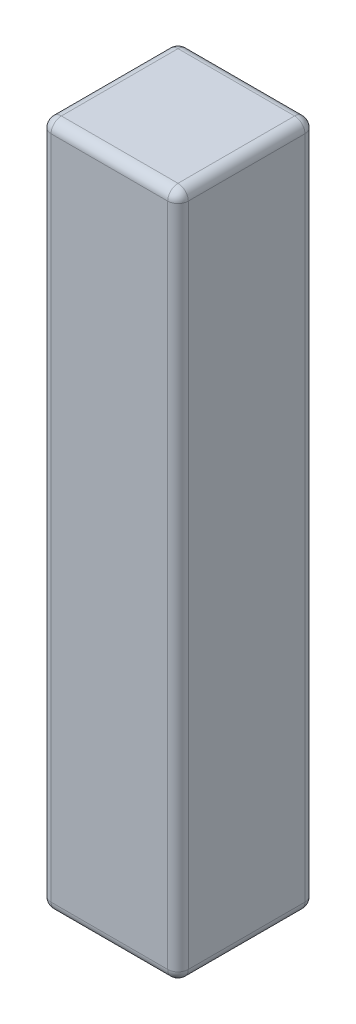
ISO-10303-21;
HEADER;
FILE_DESCRIPTION(('STEP AP214'),'2;1');
FILE_NAME('part.step','',(''),(''),'','','');
FILE_SCHEMA(('AUTOMOTIVE_DESIGN { 1 0 10303 214 1 1 1 1 }'));
ENDSEC;
DATA;
#1=APPLICATION_CONTEXT('core data for automotive mechanical design processes');
#2=APPLICATION_PROTOCOL_DEFINITION('international standard','automotive_design',2000,#1);
#3=PRODUCT_CONTEXT('',#1,'mechanical');
#4=PRODUCT('Part','Part','',(#3));
#5=PRODUCT_RELATED_PRODUCT_CATEGORY('part','',(#4));
#6=PRODUCT_DEFINITION_FORMATION('','',#4);
#7=PRODUCT_DEFINITION_CONTEXT('part definition',#1,'design');
#8=PRODUCT_DEFINITION('design','',#6,#7);
#9=PRODUCT_DEFINITION_SHAPE('','',#8);
#10=(LENGTH_UNIT() NAMED_UNIT(*) SI_UNIT(.MILLI.,.METRE.));
#11=(NAMED_UNIT(*) PLANE_ANGLE_UNIT() SI_UNIT($,.RADIAN.));
#12=(NAMED_UNIT(*) SI_UNIT($,.STERADIAN.) SOLID_ANGLE_UNIT());
#13=UNCERTAINTY_MEASURE_WITH_UNIT(LENGTH_MEASURE(1.E-05),#10,'distance_accuracy_value','');
#14=(GEOMETRIC_REPRESENTATION_CONTEXT(3) GLOBAL_UNCERTAINTY_ASSIGNED_CONTEXT((#13)) GLOBAL_UNIT_ASSIGNED_CONTEXT((#10,
#11,#12)) REPRESENTATION_CONTEXT('',''));
#15=CARTESIAN_POINT('',(0.,0.,0.));
#16=DIRECTION('',(0.,0.,1.));
#17=DIRECTION('',(1.,0.,0.));
#18=AXIS2_PLACEMENT_3D('',#15,#16,#17);
#19=CARTESIAN_POINT('',(-1.00000054,5.,-1.00000054));
#20=DIRECTION('',(1.,0.,0.));
#21=DIRECTION('',(0.,0.,-1.));
#22=AXIS2_PLACEMENT_3D('',#19,#20,#21);
#23=PLANE('',#22);
#24=DIRECTION('',(0.,-1.,0.));
#25=VECTOR('',#24,1.);
#26=CARTESIAN_POINT('',(-1.00000054,5.,0.85000054));
#27=LINE('',#26,#25);
#28=CARTESIAN_POINT('',(-1.00000054,-4.85,0.85000054));
#29=VERTEX_POINT('',#28);
#30=CARTESIAN_POINT('',(-1.00000054,4.85,0.85000054));
#31=VERTEX_POINT('',#30);
#32=EDGE_CURVE('E214',#29,#31,#27,.F.);
#33=ORIENTED_EDGE('',*,*,#32,.T.);
#34=DIRECTION('',(0.,0.,1.));
#35=VECTOR('',#34,1.);
#36=CARTESIAN_POINT('',(-1.00000054,4.85,-1.00000054));
#37=LINE('',#36,#35);
#38=CARTESIAN_POINT('',(-1.00000054,4.85,-0.85000054));
#39=VERTEX_POINT('',#38);
#40=EDGE_CURVE('E217',#31,#39,#37,.F.);
#41=ORIENTED_EDGE('',*,*,#40,.T.);
#42=DIRECTION('',(0.,-1.,0.));
#43=VECTOR('',#42,1.);
#44=CARTESIAN_POINT('',(-1.00000054,5.,-0.85000054));
#45=LINE('',#44,#43);
#46=CARTESIAN_POINT('',(-1.00000054,-4.85,-0.85000054));
#47=VERTEX_POINT('',#46);
#48=EDGE_CURVE('E215',#39,#47,#45,.T.);
#49=ORIENTED_EDGE('',*,*,#48,.T.);
#50=DIRECTION('',(0.,0.,1.));
#51=VECTOR('',#50,1.);
#52=CARTESIAN_POINT('',(-1.00000054,-4.85,-1.00000054));
#53=LINE('',#52,#51);
#54=EDGE_CURVE('E211',#47,#29,#53,.T.);
#55=ORIENTED_EDGE('',*,*,#54,.T.);
#56=EDGE_LOOP('',(#33,#41,#49,#55));
#57=FACE_BOUND('',#56,.T.);
#58=ADVANCED_FACE('F32',(#57),#23,.F.);
#59=CARTESIAN_POINT('',(-1.00000054,5.,1.00000054));
#60=DIRECTION('',(0.,0.,-1.));
#61=DIRECTION('',(-1.,0.,0.));
#62=AXIS2_PLACEMENT_3D('',#59,#60,#61);
#63=PLANE('',#62);
#64=DIRECTION('',(1.,0.,0.));
#65=VECTOR('',#64,1.);
#66=CARTESIAN_POINT('',(-1.00000054,-4.85,1.00000054));
#67=LINE('',#66,#65);
#68=CARTESIAN_POINT('',(-0.850000540000001,-4.85,1.00000054));
#69=VERTEX_POINT('',#68);
#70=CARTESIAN_POINT('',(0.85000054,-4.85,1.00000054));
#71=VERTEX_POINT('',#70);
#72=EDGE_CURVE('E255',#69,#71,#67,.T.);
#73=ORIENTED_EDGE('',*,*,#72,.T.);
#74=DIRECTION('',(0.,-1.,0.));
#75=VECTOR('',#74,1.);
#76=CARTESIAN_POINT('',(0.85000054,5.,1.00000054));
#77=LINE('',#76,#75);
#78=CARTESIAN_POINT('',(0.85000054,4.85,1.00000054));
#79=VERTEX_POINT('',#78);
#80=EDGE_CURVE('E261',#71,#79,#77,.F.);
#81=ORIENTED_EDGE('',*,*,#80,.T.);
#82=DIRECTION('',(1.,0.,0.));
#83=VECTOR('',#82,1.);
#84=CARTESIAN_POINT('',(-1.00000054,4.85,1.00000054));
#85=LINE('',#84,#83);
#86=CARTESIAN_POINT('',(-0.850000540000001,4.85,1.00000054));
#87=VERTEX_POINT('',#86);
#88=EDGE_CURVE('E258',#79,#87,#85,.F.);
#89=ORIENTED_EDGE('',*,*,#88,.T.);
#90=DIRECTION('',(0.,-1.,0.));
#91=VECTOR('',#90,1.);
#92=CARTESIAN_POINT('',(-0.850000540000001,5.,1.00000054));
#93=LINE('',#92,#91);
#94=EDGE_CURVE('E250',#87,#69,#93,.T.);
#95=ORIENTED_EDGE('',*,*,#94,.T.);
#96=EDGE_LOOP('',(#73,#81,#89,#95));
#97=FACE_BOUND('',#96,.T.);
#98=ADVANCED_FACE('F259',(#97),#63,.F.);
#99=CARTESIAN_POINT('',(1.00000054,5.,-1.00000054));
#100=DIRECTION('',(-1.,0.,0.));
#101=DIRECTION('',(0.,0.,1.));
#102=AXIS2_PLACEMENT_3D('',#99,#100,#101);
#103=PLANE('',#102);
#104=DIRECTION('',(0.,0.,-1.));
#105=VECTOR('',#104,1.);
#106=CARTESIAN_POINT('',(1.00000054,4.85,1.00000054));
#107=LINE('',#106,#105);
#108=CARTESIAN_POINT('',(1.00000054,4.85,-0.85000054));
#109=VERTEX_POINT('',#108);
#110=CARTESIAN_POINT('',(1.00000054,4.85,0.85000054));
#111=VERTEX_POINT('',#110);
#112=EDGE_CURVE('E151',#109,#111,#107,.F.);
#113=ORIENTED_EDGE('',*,*,#112,.T.);
#114=DIRECTION('',(0.,-1.,0.));
#115=VECTOR('',#114,1.);
#116=CARTESIAN_POINT('',(1.00000054,5.,0.85000054));
#117=LINE('',#116,#115);
#118=CARTESIAN_POINT('',(1.00000054,-4.85,0.85000054));
#119=VERTEX_POINT('',#118);
#120=EDGE_CURVE('E219',#111,#119,#117,.T.);
#121=ORIENTED_EDGE('',*,*,#120,.T.);
#122=DIRECTION('',(0.,0.,-1.));
#123=VECTOR('',#122,1.);
#124=CARTESIAN_POINT('',(1.00000054,-4.85,-1.00000054));
#125=LINE('',#124,#123);
#126=CARTESIAN_POINT('',(1.00000054,-4.85,-0.85000054));
#127=VERTEX_POINT('',#126);
#128=EDGE_CURVE('E278',#119,#127,#125,.T.);
#129=ORIENTED_EDGE('',*,*,#128,.T.);
#130=DIRECTION('',(0.,-1.,0.));
#131=VECTOR('',#130,1.);
#132=CARTESIAN_POINT('',(1.00000054,5.,-0.85000054));
#133=LINE('',#132,#131);
#134=EDGE_CURVE('E276',#127,#109,#133,.F.);
#135=ORIENTED_EDGE('',*,*,#134,.T.);
#136=EDGE_LOOP('',(#113,#121,#129,#135));
#137=FACE_BOUND('',#136,.T.);
#138=ADVANCED_FACE('F283',(#137),#103,.F.);
#139=CARTESIAN_POINT('',(-1.00000054,5.,-1.00000054));
#140=DIRECTION('',(0.,0.,1.));
#141=DIRECTION('',(1.,0.,0.));
#142=AXIS2_PLACEMENT_3D('',#139,#140,#141);
#143=PLANE('',#142);
#144=DIRECTION('',(-1.,0.,0.));
#145=VECTOR('',#144,1.);
#146=CARTESIAN_POINT('',(1.00000054,4.85,-1.00000054));
#147=LINE('',#146,#145);
#148=CARTESIAN_POINT('',(-0.85000054,4.85,-1.00000054));
#149=VERTEX_POINT('',#148);
#150=CARTESIAN_POINT('',(0.85000054,4.85,-1.00000054));
#151=VERTEX_POINT('',#150);
#152=EDGE_CURVE('E41',#149,#151,#147,.F.);
#153=ORIENTED_EDGE('',*,*,#152,.T.);
#154=DIRECTION('',(0.,-1.,0.));
#155=VECTOR('',#154,1.);
#156=CARTESIAN_POINT('',(0.85000054,5.,-1.00000054));
#157=LINE('',#156,#155);
#158=CARTESIAN_POINT('',(0.85000054,-4.85,-1.00000054));
#159=VERTEX_POINT('',#158);
#160=EDGE_CURVE('E11',#151,#159,#157,.T.);
#161=ORIENTED_EDGE('',*,*,#160,.T.);
#162=DIRECTION('',(-1.,0.,0.));
#163=VECTOR('',#162,1.);
#164=CARTESIAN_POINT('',(-1.00000054,-4.85,-1.00000054));
#165=LINE('',#164,#163);
#166=CARTESIAN_POINT('',(-0.85000054,-4.85,-1.00000054));
#167=VERTEX_POINT('',#166);
#168=EDGE_CURVE('E225',#159,#167,#165,.T.);
#169=ORIENTED_EDGE('',*,*,#168,.T.);
#170=DIRECTION('',(0.,-1.,0.));
#171=VECTOR('',#170,1.);
#172=CARTESIAN_POINT('',(-0.85000054,5.,-1.00000054));
#173=LINE('',#172,#171);
#174=EDGE_CURVE('E52',#167,#149,#173,.F.);
#175=ORIENTED_EDGE('',*,*,#174,.T.);
#176=EDGE_LOOP('',(#153,#161,#169,#175));
#177=FACE_BOUND('',#176,.T.);
#178=ADVANCED_FACE('F354',(#177),#143,.F.);
#179=CARTESIAN_POINT('',(-1.00000054,5.,1.00000054));
#180=DIRECTION('',(0.,1.,0.));
#181=DIRECTION('',(0.,0.,1.));
#182=AXIS2_PLACEMENT_3D('',#179,#180,#181);
#183=PLANE('',#182);
#184=DIRECTION('',(0.,0.,1.));
#185=VECTOR('',#184,1.);
#186=CARTESIAN_POINT('',(-0.850000540000001,5.,1.00000054));
#187=LINE('',#186,#185);
#188=CARTESIAN_POINT('',(-0.85000054,5.,-0.85000054));
#189=VERTEX_POINT('',#188);
#190=CARTESIAN_POINT('',(-0.850000540000001,5.,0.85000054));
#191=VERTEX_POINT('',#190);
#192=EDGE_CURVE('E130',#189,#191,#187,.T.);
#193=ORIENTED_EDGE('',*,*,#192,.T.);
#194=DIRECTION('',(1.,0.,0.));
#195=VECTOR('',#194,1.);
#196=CARTESIAN_POINT('',(1.00000054,5.,0.85000054));
#197=LINE('',#196,#195);
#198=CARTESIAN_POINT('',(0.85000054,5.,0.85000054));
#199=VERTEX_POINT('',#198);
#200=EDGE_CURVE('E126',#191,#199,#197,.T.);
#201=ORIENTED_EDGE('',*,*,#200,.T.);
#202=DIRECTION('',(0.,0.,-1.));
#203=VECTOR('',#202,1.);
#204=CARTESIAN_POINT('',(0.85000054,5.,-1.00000054));
#205=LINE('',#204,#203);
#206=CARTESIAN_POINT('',(0.85000054,5.,-0.85000054));
#207=VERTEX_POINT('',#206);
#208=EDGE_CURVE('E120',#199,#207,#205,.T.);
#209=ORIENTED_EDGE('',*,*,#208,.T.);
#210=DIRECTION('',(-1.,0.,0.));
#211=VECTOR('',#210,1.);
#212=CARTESIAN_POINT('',(-1.00000054,5.,-0.85000054));
#213=LINE('',#212,#211);
#214=EDGE_CURVE('E123',#207,#189,#213,.T.);
#215=ORIENTED_EDGE('',*,*,#214,.T.);
#216=EDGE_LOOP('',(#193,#201,#209,#215));
#217=FACE_BOUND('',#216,.T.);
#218=ADVANCED_FACE('F122',(#217),#183,.T.);
#219=CARTESIAN_POINT('',(-1.00000054,-5.,1.00000054));
#220=DIRECTION('',(0.,1.,0.));
#221=DIRECTION('',(0.,0.,1.));
#222=AXIS2_PLACEMENT_3D('',#219,#220,#221);
#223=PLANE('',#222);
#224=DIRECTION('',(0.,0.,-1.));
#225=VECTOR('',#224,1.);
#226=CARTESIAN_POINT('',(0.85000054,-5.,1.00000054));
#227=LINE('',#226,#225);
#228=CARTESIAN_POINT('',(0.85000054,-5.,-0.85000054));
#229=VERTEX_POINT('',#228);
#230=CARTESIAN_POINT('',(0.85000054,-5.,0.85000054));
#231=VERTEX_POINT('',#230);
#232=EDGE_CURVE('E272',#229,#231,#227,.F.);
#233=ORIENTED_EDGE('',*,*,#232,.T.);
#234=DIRECTION('',(1.,0.,0.));
#235=VECTOR('',#234,1.);
#236=CARTESIAN_POINT('',(-1.00000054,-5.,0.85000054));
#237=LINE('',#236,#235);
#238=CARTESIAN_POINT('',(-0.85000054,-5.,0.85000054));
#239=VERTEX_POINT('',#238);
#240=EDGE_CURVE('E274',#231,#239,#237,.F.);
#241=ORIENTED_EDGE('',*,*,#240,.T.);
#242=DIRECTION('',(0.,0.,1.));
#243=VECTOR('',#242,1.);
#244=CARTESIAN_POINT('',(-0.850000540000001,-5.,1.00000054));
#245=LINE('',#244,#243);
#246=CARTESIAN_POINT('',(-0.85000054,-5.,-0.85000054));
#247=VERTEX_POINT('',#246);
#248=EDGE_CURVE('E209',#239,#247,#245,.F.);
#249=ORIENTED_EDGE('',*,*,#248,.T.);
#250=DIRECTION('',(-1.,0.,0.));
#251=VECTOR('',#250,1.);
#252=CARTESIAN_POINT('',(-1.00000054,-5.,-0.85000054));
#253=LINE('',#252,#251);
#254=EDGE_CURVE('E266',#247,#229,#253,.F.);
#255=ORIENTED_EDGE('',*,*,#254,.T.);
#256=EDGE_LOOP('',(#233,#241,#249,#255));
#257=FACE_BOUND('',#256,.T.);
#258=ADVANCED_FACE('F355',(#257),#223,.F.);
#259=CARTESIAN_POINT('',(-1.00000054,-4.85,-0.85000054));
#260=DIRECTION('',(-1.,0.,0.));
#261=DIRECTION('',(0.,0.,1.));
#262=AXIS2_PLACEMENT_3D('',#259,#260,#261);
#263=CYLINDRICAL_SURFACE('',#262,0.15);
#264=CARTESIAN_POINT('',(-0.85000054,-4.85,-0.85000054));
#265=DIRECTION('',(-1.,0.,0.));
#266=DIRECTION('',(0.,0.,1.));
#267=AXIS2_PLACEMENT_3D('',#264,#265,#266);
#268=CIRCLE('',#267,0.15);
#269=EDGE_CURVE('E36',#167,#247,#268,.T.);
#270=ORIENTED_EDGE('',*,*,#269,.F.);
#271=ORIENTED_EDGE('',*,*,#168,.F.);
#272=CARTESIAN_POINT('',(0.85000054,-4.85,-0.85000054));
#273=DIRECTION('',(1.,0.,0.));
#274=DIRECTION('',(0.,0.,-1.));
#275=AXIS2_PLACEMENT_3D('',#272,#273,#274);
#276=CIRCLE('',#275,0.15);
#277=EDGE_CURVE('E189',#229,#159,#276,.T.);
#278=ORIENTED_EDGE('',*,*,#277,.F.);
#279=ORIENTED_EDGE('',*,*,#254,.F.);
#280=EDGE_LOOP('',(#270,#271,#278,#279));
#281=FACE_BOUND('',#280,.T.);
#282=ADVANCED_FACE('F34',(#281),#263,.T.);
#283=CARTESIAN_POINT('',(-0.85000054,-4.85,-0.85000054));
#284=DIRECTION('',(0.,0.,1.));
#285=DIRECTION('',(1.,0.,0.));
#286=AXIS2_PLACEMENT_3D('',#283,#284,#285);
#287=SPHERICAL_SURFACE('',#286,0.15);
#288=CARTESIAN_POINT('',(-0.85000054,-4.85,-0.85000054));
#289=DIRECTION('',(0.,-1.,0.));
#290=DIRECTION('',(0.,0.,-1.));
#291=AXIS2_PLACEMENT_3D('',#288,#289,#290);
#292=CIRCLE('',#291,0.15);
#293=EDGE_CURVE('E184',#167,#47,#292,.F.);
#294=ORIENTED_EDGE('',*,*,#293,.F.);
#295=ORIENTED_EDGE('',*,*,#269,.T.);
#296=CARTESIAN_POINT('',(-0.85000054,-4.85,-0.85000054));
#297=DIRECTION('',(0.,0.,-1.));
#298=DIRECTION('',(-1.,0.,0.));
#299=AXIS2_PLACEMENT_3D('',#296,#297,#298);
#300=CIRCLE('',#299,0.15);
#301=EDGE_CURVE('E187',#47,#247,#300,.F.);
#302=ORIENTED_EDGE('',*,*,#301,.F.);
#303=EDGE_LOOP('',(#294,#295,#302));
#304=FACE_BOUND('',#303,.T.);
#305=ADVANCED_FACE('F201',(#304),#287,.T.);
#306=CARTESIAN_POINT('',(0.85000054,-4.85,-0.85000054));
#307=DIRECTION('',(0.,0.,1.));
#308=DIRECTION('',(1.,0.,0.));
#309=AXIS2_PLACEMENT_3D('',#306,#307,#308);
#310=SPHERICAL_SURFACE('',#309,0.15);
#311=CARTESIAN_POINT('',(0.85000054,-4.85,-0.85000054));
#312=DIRECTION('',(0.,0.,-1.));
#313=DIRECTION('',(-1.,0.,0.));
#314=AXIS2_PLACEMENT_3D('',#311,#312,#313);
#315=CIRCLE('',#314,0.15);
#316=EDGE_CURVE('E179',#229,#127,#315,.F.);
#317=ORIENTED_EDGE('',*,*,#316,.F.);
#318=ORIENTED_EDGE('',*,*,#277,.T.);
#319=CARTESIAN_POINT('',(0.85000054,-4.85,-0.85000054));
#320=DIRECTION('',(0.,-1.,0.));
#321=DIRECTION('',(0.,0.,-1.));
#322=AXIS2_PLACEMENT_3D('',#319,#320,#321);
#323=CIRCLE('',#322,0.15);
#324=EDGE_CURVE('E182',#127,#159,#323,.F.);
#325=ORIENTED_EDGE('',*,*,#324,.F.);
#326=EDGE_LOOP('',(#317,#318,#325));
#327=FACE_BOUND('',#326,.T.);
#328=ADVANCED_FACE('F351',(#327),#310,.T.);
#329=CARTESIAN_POINT('',(-0.85000054,-4.85,-1.00000054));
#330=DIRECTION('',(0.,0.,1.));
#331=DIRECTION('',(1.,0.,0.));
#332=AXIS2_PLACEMENT_3D('',#329,#330,#331);
#333=CYLINDRICAL_SURFACE('',#332,0.15);
#334=ORIENTED_EDGE('',*,*,#301,.T.);
#335=ORIENTED_EDGE('',*,*,#248,.F.);
#336=CARTESIAN_POINT('',(-0.85000054,-4.85,0.85000054));
#337=DIRECTION('',(0.,0.,1.));
#338=DIRECTION('',(1.,0.,0.));
#339=AXIS2_PLACEMENT_3D('',#336,#337,#338);
#340=CIRCLE('',#339,0.15);
#341=EDGE_CURVE('E174',#29,#239,#340,.T.);
#342=ORIENTED_EDGE('',*,*,#341,.F.);
#343=ORIENTED_EDGE('',*,*,#54,.F.);
#344=EDGE_LOOP('',(#334,#335,#342,#343));
#345=FACE_BOUND('',#344,.T.);
#346=ADVANCED_FACE('F207',(#345),#333,.T.);
#347=CARTESIAN_POINT('',(-0.85000054,5.,-0.85000054));
#348=DIRECTION('',(0.,-1.,0.));
#349=DIRECTION('',(0.,0.,-1.));
#350=AXIS2_PLACEMENT_3D('',#347,#348,#349);
#351=CYLINDRICAL_SURFACE('',#350,0.15);
#352=ORIENTED_EDGE('',*,*,#293,.T.);
#353=ORIENTED_EDGE('',*,*,#48,.F.);
#354=CARTESIAN_POINT('',(-0.85000054,4.85,-0.85000054));
#355=DIRECTION('',(0.,1.,0.));
#356=DIRECTION('',(0.,0.,1.));
#357=AXIS2_PLACEMENT_3D('',#354,#355,#356);
#358=CIRCLE('',#357,0.15);
#359=EDGE_CURVE('E171',#149,#39,#358,.T.);
#360=ORIENTED_EDGE('',*,*,#359,.F.);
#361=ORIENTED_EDGE('',*,*,#174,.F.);
#362=EDGE_LOOP('',(#352,#353,#360,#361));
#363=FACE_BOUND('',#362,.T.);
#364=ADVANCED_FACE('F300',(#363),#351,.T.);
#365=CARTESIAN_POINT('',(-1.00000054,4.85,-0.85000054));
#366=DIRECTION('',(1.,0.,0.));
#367=DIRECTION('',(0.,0.,-1.));
#368=AXIS2_PLACEMENT_3D('',#365,#366,#367);
#369=CYLINDRICAL_SURFACE('',#368,0.15);
#370=CARTESIAN_POINT('',(0.85000054,4.85,-0.85000054));
#371=DIRECTION('',(1.,0.,0.));
#372=DIRECTION('',(0.,0.,-1.));
#373=AXIS2_PLACEMENT_3D('',#370,#371,#372);
#374=CIRCLE('',#373,0.15);
#375=EDGE_CURVE('E136',#151,#207,#374,.T.);
#376=ORIENTED_EDGE('',*,*,#375,.F.);
#377=ORIENTED_EDGE('',*,*,#152,.F.);
#378=CARTESIAN_POINT('',(-0.85000054,4.85,-0.85000054));
#379=DIRECTION('',(-1.,0.,0.));
#380=DIRECTION('',(0.,0.,1.));
#381=AXIS2_PLACEMENT_3D('',#378,#379,#380);
#382=CIRCLE('',#381,0.15);
#383=EDGE_CURVE('E139',#189,#149,#382,.T.);
#384=ORIENTED_EDGE('',*,*,#383,.F.);
#385=ORIENTED_EDGE('',*,*,#214,.F.);
#386=EDGE_LOOP('',(#376,#377,#384,#385));
#387=FACE_BOUND('',#386,.T.);
#388=ADVANCED_FACE('F135',(#387),#369,.T.);
#389=CARTESIAN_POINT('',(0.85000054,5.,-0.85000054));
#390=DIRECTION('',(0.,-1.,0.));
#391=DIRECTION('',(0.,0.,-1.));
#392=AXIS2_PLACEMENT_3D('',#389,#390,#391);
#393=CYLINDRICAL_SURFACE('',#392,0.15);
#394=ORIENTED_EDGE('',*,*,#324,.T.);
#395=ORIENTED_EDGE('',*,*,#160,.F.);
#396=CARTESIAN_POINT('',(0.85000054,4.85,-0.85000054));
#397=DIRECTION('',(0.,1.,0.));
#398=DIRECTION('',(0.,0.,1.));
#399=AXIS2_PLACEMENT_3D('',#396,#397,#398);
#400=CIRCLE('',#399,0.15);
#401=EDGE_CURVE('E148',#109,#151,#400,.T.);
#402=ORIENTED_EDGE('',*,*,#401,.F.);
#403=ORIENTED_EDGE('',*,*,#134,.F.);
#404=EDGE_LOOP('',(#394,#395,#402,#403));
#405=FACE_BOUND('',#404,.T.);
#406=ADVANCED_FACE('F353',(#405),#393,.T.);
#407=CARTESIAN_POINT('',(0.85000054,-4.85,-1.00000054));
#408=DIRECTION('',(0.,0.,-1.));
#409=DIRECTION('',(-1.,0.,0.));
#410=AXIS2_PLACEMENT_3D('',#407,#408,#409);
#411=CYLINDRICAL_SURFACE('',#410,0.15);
#412=ORIENTED_EDGE('',*,*,#316,.T.);
#413=ORIENTED_EDGE('',*,*,#128,.F.);
#414=CARTESIAN_POINT('',(0.85000054,-4.85,0.85000054));
#415=DIRECTION('',(0.,0.,1.));
#416=DIRECTION('',(1.,0.,0.));
#417=AXIS2_PLACEMENT_3D('',#414,#415,#416);
#418=CIRCLE('',#417,0.15);
#419=EDGE_CURVE('E166',#231,#119,#418,.T.);
#420=ORIENTED_EDGE('',*,*,#419,.F.);
#421=ORIENTED_EDGE('',*,*,#232,.F.);
#422=EDGE_LOOP('',(#412,#413,#420,#421));
#423=FACE_BOUND('',#422,.T.);
#424=ADVANCED_FACE('F349',(#423),#411,.T.);
#425=CARTESIAN_POINT('',(-1.00000054,-4.85,0.85000054));
#426=DIRECTION('',(1.,0.,0.));
#427=DIRECTION('',(0.,0.,-1.));
#428=AXIS2_PLACEMENT_3D('',#425,#426,#427);
#429=CYLINDRICAL_SURFACE('',#428,0.15);
#430=CARTESIAN_POINT('',(-0.85000054,-4.85,0.85000054));
#431=DIRECTION('',(-1.,0.,0.));
#432=DIRECTION('',(0.,0.,1.));
#433=AXIS2_PLACEMENT_3D('',#430,#431,#432);
#434=CIRCLE('',#433,0.15);
#435=EDGE_CURVE('E176',#239,#69,#434,.T.);
#436=ORIENTED_EDGE('',*,*,#435,.F.);
#437=ORIENTED_EDGE('',*,*,#240,.F.);
#438=CARTESIAN_POINT('',(0.85000054,-4.85,0.85000054));
#439=DIRECTION('',(1.,0.,0.));
#440=DIRECTION('',(0.,0.,-1.));
#441=AXIS2_PLACEMENT_3D('',#438,#439,#440);
#442=CIRCLE('',#441,0.15);
#443=EDGE_CURVE('E163',#71,#231,#442,.T.);
#444=ORIENTED_EDGE('',*,*,#443,.F.);
#445=ORIENTED_EDGE('',*,*,#72,.F.);
#446=EDGE_LOOP('',(#436,#437,#444,#445));
#447=FACE_BOUND('',#446,.T.);
#448=ADVANCED_FACE('F312',(#447),#429,.T.);
#449=CARTESIAN_POINT('',(-0.85000054,-4.85,0.85000054));
#450=DIRECTION('',(0.,0.,1.));
#451=DIRECTION('',(1.,0.,0.));
#452=AXIS2_PLACEMENT_3D('',#449,#450,#451);
#453=SPHERICAL_SURFACE('',#452,0.15);
#454=ORIENTED_EDGE('',*,*,#341,.T.);
#455=ORIENTED_EDGE('',*,*,#435,.T.);
#456=CARTESIAN_POINT('',(-0.85000054,-4.85,0.85000054));
#457=DIRECTION('',(0.,-1.,0.));
#458=DIRECTION('',(0.,0.,-1.));
#459=AXIS2_PLACEMENT_3D('',#456,#457,#458);
#460=CIRCLE('',#459,0.15);
#461=EDGE_CURVE('E155',#29,#69,#460,.F.);
#462=ORIENTED_EDGE('',*,*,#461,.F.);
#463=EDGE_LOOP('',(#454,#455,#462));
#464=FACE_BOUND('',#463,.T.);
#465=ADVANCED_FACE('F304',(#464),#453,.T.);
#466=CARTESIAN_POINT('',(-0.85000054,4.85,-0.85000054));
#467=DIRECTION('',(0.,0.,1.));
#468=DIRECTION('',(1.,0.,0.));
#469=AXIS2_PLACEMENT_3D('',#466,#467,#468);
#470=SPHERICAL_SURFACE('',#469,0.15);
#471=ORIENTED_EDGE('',*,*,#383,.T.);
#472=ORIENTED_EDGE('',*,*,#359,.T.);
#473=CARTESIAN_POINT('',(-0.85000054,4.85,-0.85000054));
#474=DIRECTION('',(0.,0.,-1.));
#475=DIRECTION('',(-1.,0.,0.));
#476=AXIS2_PLACEMENT_3D('',#473,#474,#475);
#477=CIRCLE('',#476,0.15);
#478=EDGE_CURVE('E152',#189,#39,#477,.F.);
#479=ORIENTED_EDGE('',*,*,#478,.F.);
#480=EDGE_LOOP('',(#471,#472,#479));
#481=FACE_BOUND('',#480,.T.);
#482=ADVANCED_FACE('F302',(#481),#470,.T.);
#483=CARTESIAN_POINT('',(0.85000054,4.85,-0.85000054));
#484=DIRECTION('',(0.,0.,1.));
#485=DIRECTION('',(1.,0.,0.));
#486=AXIS2_PLACEMENT_3D('',#483,#484,#485);
#487=SPHERICAL_SURFACE('',#486,0.15);
#488=ORIENTED_EDGE('',*,*,#401,.T.);
#489=ORIENTED_EDGE('',*,*,#375,.T.);
#490=CARTESIAN_POINT('',(0.85000054,4.85,-0.85000054));
#491=DIRECTION('',(0.,0.,-1.));
#492=DIRECTION('',(-1.,0.,0.));
#493=AXIS2_PLACEMENT_3D('',#490,#491,#492);
#494=CIRCLE('',#493,0.15);
#495=EDGE_CURVE('E145',#109,#207,#494,.F.);
#496=ORIENTED_EDGE('',*,*,#495,.F.);
#497=EDGE_LOOP('',(#488,#489,#496));
#498=FACE_BOUND('',#497,.T.);
#499=ADVANCED_FACE('F144',(#498),#487,.T.);
#500=CARTESIAN_POINT('',(0.85000054,-4.85,0.85000054));
#501=DIRECTION('',(0.,0.,1.));
#502=DIRECTION('',(1.,0.,0.));
#503=AXIS2_PLACEMENT_3D('',#500,#501,#502);
#504=SPHERICAL_SURFACE('',#503,0.15);
#505=ORIENTED_EDGE('',*,*,#443,.T.);
#506=ORIENTED_EDGE('',*,*,#419,.T.);
#507=CARTESIAN_POINT('',(0.85000054,-4.85,0.85000054));
#508=DIRECTION('',(0.,-1.,0.));
#509=DIRECTION('',(0.,0.,-1.));
#510=AXIS2_PLACEMENT_3D('',#507,#508,#509);
#511=CIRCLE('',#510,0.15);
#512=EDGE_CURVE('E153',#71,#119,#511,.F.);
#513=ORIENTED_EDGE('',*,*,#512,.F.);
#514=EDGE_LOOP('',(#505,#506,#513));
#515=FACE_BOUND('',#514,.T.);
#516=ADVANCED_FACE('F310',(#515),#504,.T.);
#517=CARTESIAN_POINT('',(-0.850000540000001,5.,0.85000054));
#518=DIRECTION('',(0.,-1.,0.));
#519=DIRECTION('',(0.,0.,-1.));
#520=AXIS2_PLACEMENT_3D('',#517,#518,#519);
#521=CYLINDRICAL_SURFACE('',#520,0.15);
#522=ORIENTED_EDGE('',*,*,#461,.T.);
#523=ORIENTED_EDGE('',*,*,#94,.F.);
#524=CARTESIAN_POINT('',(-0.850000540000001,4.85,0.85000054));
#525=DIRECTION('',(0.,1.,0.));
#526=DIRECTION('',(0.,0.,1.));
#527=AXIS2_PLACEMENT_3D('',#524,#525,#526);
#528=CIRCLE('',#527,0.15);
#529=EDGE_CURVE('E157',#31,#87,#528,.T.);
#530=ORIENTED_EDGE('',*,*,#529,.F.);
#531=ORIENTED_EDGE('',*,*,#32,.F.);
#532=EDGE_LOOP('',(#522,#523,#530,#531));
#533=FACE_BOUND('',#532,.T.);
#534=ADVANCED_FACE('F252',(#533),#521,.T.);
#535=CARTESIAN_POINT('',(-0.850000540000001,4.85,1.00000054));
#536=DIRECTION('',(0.,0.,-1.));
#537=DIRECTION('',(-1.,0.,0.));
#538=AXIS2_PLACEMENT_3D('',#535,#536,#537);
#539=CYLINDRICAL_SURFACE('',#538,0.15);
#540=ORIENTED_EDGE('',*,*,#478,.T.);
#541=ORIENTED_EDGE('',*,*,#40,.F.);
#542=CARTESIAN_POINT('',(-0.850000540000001,4.85,0.85000054));
#543=DIRECTION('',(0.,0.,1.));
#544=DIRECTION('',(1.,0.,0.));
#545=AXIS2_PLACEMENT_3D('',#542,#543,#544);
#546=CIRCLE('',#545,0.15);
#547=EDGE_CURVE('E239',#191,#31,#546,.T.);
#548=ORIENTED_EDGE('',*,*,#547,.F.);
#549=ORIENTED_EDGE('',*,*,#192,.F.);
#550=EDGE_LOOP('',(#540,#541,#548,#549));
#551=FACE_BOUND('',#550,.T.);
#552=ADVANCED_FACE('F296',(#551),#539,.T.);
#553=CARTESIAN_POINT('',(0.85000054,4.85,1.00000054));
#554=DIRECTION('',(0.,0.,1.));
#555=DIRECTION('',(1.,0.,0.));
#556=AXIS2_PLACEMENT_3D('',#553,#554,#555);
#557=CYLINDRICAL_SURFACE('',#556,0.15);
#558=ORIENTED_EDGE('',*,*,#495,.T.);
#559=ORIENTED_EDGE('',*,*,#208,.F.);
#560=CARTESIAN_POINT('',(0.85000054,4.85,0.85000054));
#561=DIRECTION('',(0.,0.,1.));
#562=DIRECTION('',(1.,0.,0.));
#563=AXIS2_PLACEMENT_3D('',#560,#561,#562);
#564=CIRCLE('',#563,0.15);
#565=EDGE_CURVE('E236',#111,#199,#564,.T.);
#566=ORIENTED_EDGE('',*,*,#565,.F.);
#567=ORIENTED_EDGE('',*,*,#112,.F.);
#568=EDGE_LOOP('',(#558,#559,#566,#567));
#569=FACE_BOUND('',#568,.T.);
#570=ADVANCED_FACE('F150',(#569),#557,.T.);
#571=CARTESIAN_POINT('',(0.85000054,5.,0.85000054));
#572=DIRECTION('',(0.,-1.,0.));
#573=DIRECTION('',(0.,0.,-1.));
#574=AXIS2_PLACEMENT_3D('',#571,#572,#573);
#575=CYLINDRICAL_SURFACE('',#574,0.15);
#576=ORIENTED_EDGE('',*,*,#512,.T.);
#577=ORIENTED_EDGE('',*,*,#120,.F.);
#578=CARTESIAN_POINT('',(0.85000054,4.85,0.85000054));
#579=DIRECTION('',(0.,1.,0.));
#580=DIRECTION('',(0.,0.,1.));
#581=AXIS2_PLACEMENT_3D('',#578,#579,#580);
#582=CIRCLE('',#581,0.15);
#583=EDGE_CURVE('E233',#79,#111,#582,.T.);
#584=ORIENTED_EDGE('',*,*,#583,.F.);
#585=ORIENTED_EDGE('',*,*,#80,.F.);
#586=EDGE_LOOP('',(#576,#577,#584,#585));
#587=FACE_BOUND('',#586,.T.);
#588=ADVANCED_FACE('F286',(#587),#575,.T.);
#589=CARTESIAN_POINT('',(-0.850000540000001,4.85,0.85000054));
#590=DIRECTION('',(0.,0.,1.));
#591=DIRECTION('',(1.,0.,0.));
#592=AXIS2_PLACEMENT_3D('',#589,#590,#591);
#593=SPHERICAL_SURFACE('',#592,0.15);
#594=ORIENTED_EDGE('',*,*,#547,.T.);
#595=ORIENTED_EDGE('',*,*,#529,.T.);
#596=CARTESIAN_POINT('',(-0.850000540000001,4.85,0.85000054));
#597=DIRECTION('',(-1.,0.,0.));
#598=DIRECTION('',(0.,0.,1.));
#599=AXIS2_PLACEMENT_3D('',#596,#597,#598);
#600=CIRCLE('',#599,0.15);
#601=EDGE_CURVE('E231',#191,#87,#600,.F.);
#602=ORIENTED_EDGE('',*,*,#601,.F.);
#603=EDGE_LOOP('',(#594,#595,#602));
#604=FACE_BOUND('',#603,.T.);
#605=ADVANCED_FACE('F246',(#604),#593,.T.);
#606=CARTESIAN_POINT('',(0.85000054,4.85,0.85000054));
#607=DIRECTION('',(0.,0.,1.));
#608=DIRECTION('',(1.,0.,0.));
#609=AXIS2_PLACEMENT_3D('',#606,#607,#608);
#610=SPHERICAL_SURFACE('',#609,0.15);
#611=ORIENTED_EDGE('',*,*,#583,.T.);
#612=ORIENTED_EDGE('',*,*,#565,.T.);
#613=CARTESIAN_POINT('',(0.85000054,4.85,0.85000054));
#614=DIRECTION('',(1.,0.,0.));
#615=DIRECTION('',(0.,0.,-1.));
#616=AXIS2_PLACEMENT_3D('',#613,#614,#615);
#617=CIRCLE('',#616,0.15);
#618=EDGE_CURVE('E229',#79,#199,#617,.F.);
#619=ORIENTED_EDGE('',*,*,#618,.F.);
#620=EDGE_LOOP('',(#611,#612,#619));
#621=FACE_BOUND('',#620,.T.);
#622=ADVANCED_FACE('F289',(#621),#610,.T.);
#623=CARTESIAN_POINT('',(-1.00000054,4.85,0.85000054));
#624=DIRECTION('',(-1.,0.,0.));
#625=DIRECTION('',(0.,0.,1.));
#626=AXIS2_PLACEMENT_3D('',#623,#624,#625);
#627=CYLINDRICAL_SURFACE('',#626,0.15);
#628=ORIENTED_EDGE('',*,*,#601,.T.);
#629=ORIENTED_EDGE('',*,*,#88,.F.);
#630=ORIENTED_EDGE('',*,*,#618,.T.);
#631=ORIENTED_EDGE('',*,*,#200,.F.);
#632=EDGE_LOOP('',(#628,#629,#630,#631));
#633=FACE_BOUND('',#632,.T.);
#634=ADVANCED_FACE('F290',(#633),#627,.T.);
#635=CLOSED_SHELL('',(#58,#98,#138,#178,#218,#258,#282,#305,#328,#346,#364,#388,#406,#424,#448,
#465,#482,#499,#516,#534,#552,#570,#588,#605,#622,#634));
#636=MANIFOLD_SOLID_BREP('B2',#635);
#637=ADVANCED_BREP_SHAPE_REPRESENTATION('',(#18,#636),#14);
#638=SHAPE_DEFINITION_REPRESENTATION(#9,#637);
ENDSEC;
END-ISO-10303-21;
